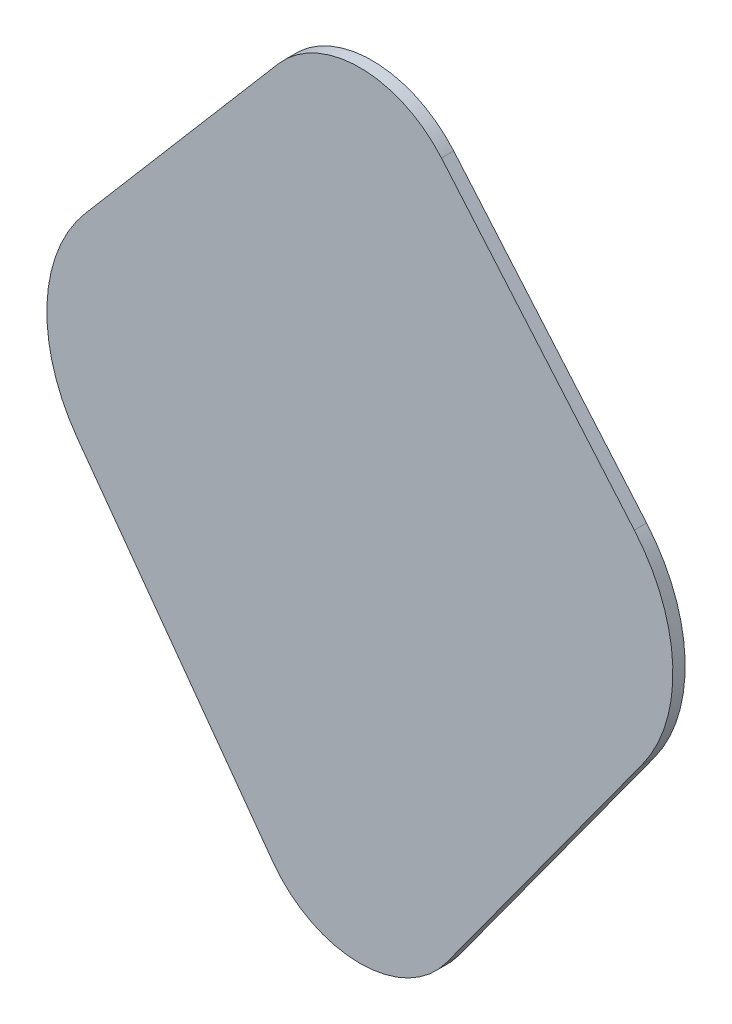
ISO-10303-21;
HEADER;
FILE_DESCRIPTION(('STEP AP214'),'2;1');
FILE_NAME('part.step','',(''),(''),'','','');
FILE_SCHEMA(('AUTOMOTIVE_DESIGN { 1 0 10303 214 1 1 1 1 }'));
ENDSEC;
DATA;
#1=APPLICATION_CONTEXT('core data for automotive mechanical design processes');
#2=APPLICATION_PROTOCOL_DEFINITION('international standard','automotive_design',2000,#1);
#3=PRODUCT_CONTEXT('',#1,'mechanical');
#4=PRODUCT('Part','Part','',(#3));
#5=PRODUCT_RELATED_PRODUCT_CATEGORY('part','',(#4));
#6=PRODUCT_DEFINITION_FORMATION('','',#4);
#7=PRODUCT_DEFINITION_CONTEXT('part definition',#1,'design');
#8=PRODUCT_DEFINITION('design','',#6,#7);
#9=PRODUCT_DEFINITION_SHAPE('','',#8);
#10=(LENGTH_UNIT() NAMED_UNIT(*) SI_UNIT(.MILLI.,.METRE.));
#11=(NAMED_UNIT(*) PLANE_ANGLE_UNIT() SI_UNIT($,.RADIAN.));
#12=(NAMED_UNIT(*) SI_UNIT($,.STERADIAN.) SOLID_ANGLE_UNIT());
#13=UNCERTAINTY_MEASURE_WITH_UNIT(LENGTH_MEASURE(1.E-05),#10,'distance_accuracy_value','');
#14=(GEOMETRIC_REPRESENTATION_CONTEXT(3) GLOBAL_UNCERTAINTY_ASSIGNED_CONTEXT((#13)) GLOBAL_UNIT_ASSIGNED_CONTEXT((#10,
#11,#12)) REPRESENTATION_CONTEXT('',''));
#15=CARTESIAN_POINT('',(0.,0.,0.));
#16=DIRECTION('',(0.,0.,1.));
#17=DIRECTION('',(1.,0.,0.));
#18=AXIS2_PLACEMENT_3D('',#15,#16,#17);
#19=CARTESIAN_POINT('',(0.,0.,0.));
#20=DIRECTION('',(0.,0.,1.));
#21=DIRECTION('',(1.,0.,0.));
#22=AXIS2_PLACEMENT_3D('',#19,#20,#21);
#23=PLANE('',#22);
#24=CARTESIAN_POINT('',(0.,54.1403788548097,0.));
#25=DIRECTION('',(0.,0.,1.));
#26=DIRECTION('',(1.,0.,0.));
#27=AXIS2_PLACEMENT_3D('',#24,#25,#26);
#28=CIRCLE('',#27,7.);
#29=CARTESIAN_POINT('',(-5.3228417592002,58.686515193121,0.));
#30=VERTEX_POINT('',#29);
#31=CARTESIAN_POINT('',(5.32284175920021,58.686515193121,0.));
#32=VERTEX_POINT('',#31);
#33=EDGE_CURVE('E148',#30,#32,#28,.F.);
#34=ORIENTED_EDGE('',*,*,#33,.T.);
#35=DIRECTION('',(-0.649448048330185,0.76040596560003,0.));
#36=VECTOR('',#35,1.);
#37=CARTESIAN_POINT('',(32.0597522343498,27.3816151641025,0.));
#38=LINE('',#37,#36);
#39=CARTESIAN_POINT('',(17.9061032827031,43.9534088980471,0.));
#40=VERTEX_POINT('',#39);
#41=EDGE_CURVE('E178',#40,#32,#38,.T.);
#42=ORIENTED_EDGE('',*,*,#41,.F.);
#43=CARTESIAN_POINT('',(9.9218406439028,37.1342043905801,0.));
#44=DIRECTION('',(0.,0.,1.));
#45=DIRECTION('',(1.,0.,0.));
#46=AXIS2_PLACEMENT_3D('',#43,#44,#45);
#47=CIRCLE('',#46,10.5);
#48=CARTESIAN_POINT('',(18.4165190848397,30.9624592415091,0.));
#49=VERTEX_POINT('',#48);
#50=EDGE_CURVE('E189',#40,#49,#47,.F.);
#51=ORIENTED_EDGE('',*,*,#50,.T.);
#52=DIRECTION('',(0.587785252292474,0.809016994374947,0.));
#53=VECTOR('',#52,1.);
#54=CARTESIAN_POINT('',(-2.66975608143732,1.93969133256516,0.));
#55=LINE('',#54,#53);
#56=CARTESIAN_POINT('',(5.66311896062463,13.4089098860047,0.));
#57=VERTEX_POINT('',#56);
#58=EDGE_CURVE('E202',#57,#49,#55,.T.);
#59=ORIENTED_EDGE('',*,*,#58,.F.);
#60=CARTESIAN_POINT('',(0.,17.523406652052,0.));
#61=DIRECTION('',(0.,0.,1.));
#62=DIRECTION('',(1.,0.,0.));
#63=AXIS2_PLACEMENT_3D('',#60,#61,#62);
#64=CIRCLE('',#63,7.);
#65=CARTESIAN_POINT('',(-5.66311896062463,13.4089098860047,0.));
#66=VERTEX_POINT('',#65);
#67=EDGE_CURVE('E143',#57,#66,#64,.F.);
#68=ORIENTED_EDGE('',*,*,#67,.T.);
#69=DIRECTION('',(0.587785252292474,-0.809016994374947,0.));
#70=VECTOR('',#69,1.);
#71=CARTESIAN_POINT('',(2.66975608143733,1.93969133256517,0.));
#72=LINE('',#71,#70);
#73=CARTESIAN_POINT('',(-18.4165190848397,30.9624592415091,0.));
#74=VERTEX_POINT('',#73);
#75=EDGE_CURVE('E135',#74,#66,#72,.T.);
#76=ORIENTED_EDGE('',*,*,#75,.F.);
#77=CARTESIAN_POINT('',(-9.92184064390279,37.1342043905801,0.));
#78=DIRECTION('',(0.,0.,1.));
#79=DIRECTION('',(1.,0.,0.));
#80=AXIS2_PLACEMENT_3D('',#77,#78,#79);
#81=CIRCLE('',#80,10.5);
#82=CARTESIAN_POINT('',(-17.9061032827031,43.9534088980471,0.));
#83=VERTEX_POINT('',#82);
#84=EDGE_CURVE('E141',#74,#83,#81,.F.);
#85=ORIENTED_EDGE('',*,*,#84,.T.);
#86=DIRECTION('',(-0.649448048330185,-0.76040596560003,0.));
#87=VECTOR('',#86,1.);
#88=CARTESIAN_POINT('',(-32.0597522343498,27.3816151641024,0.));
#89=LINE('',#88,#87);
#90=EDGE_CURVE('E146',#30,#83,#89,.T.);
#91=ORIENTED_EDGE('',*,*,#90,.F.);
#92=EDGE_LOOP('',(#34,#42,#51,#59,#68,#76,#85,#91));
#93=FACE_BOUND('',#92,.T.);
#94=ADVANCED_FACE('F59',(#93),#23,.F.);
#95=CARTESIAN_POINT('',(0.,17.523406652052,0.));
#96=DIRECTION('',(0.,0.,1.));
#97=DIRECTION('',(1.,0.,0.));
#98=AXIS2_PLACEMENT_3D('',#95,#96,#97);
#99=CYLINDRICAL_SURFACE('',#98,7.);
#100=ORIENTED_EDGE('',*,*,#67,.F.);
#101=DIRECTION('',(0.,0.,-1.));
#102=VECTOR('',#101,1.);
#103=CARTESIAN_POINT('',(5.66311896062463,13.4089098860047,0.));
#104=LINE('',#103,#102);
#105=CARTESIAN_POINT('',(5.66311896062463,13.4089098860047,0.8));
#106=VERTEX_POINT('',#105);
#107=EDGE_CURVE('E204',#106,#57,#104,.T.);
#108=ORIENTED_EDGE('',*,*,#107,.F.);
#109=CARTESIAN_POINT('',(0.,17.523406652052,0.8));
#110=DIRECTION('',(0.,0.,1.));
#111=DIRECTION('',(1.,0.,0.));
#112=AXIS2_PLACEMENT_3D('',#109,#110,#111);
#113=CIRCLE('',#112,7.);
#114=CARTESIAN_POINT('',(-5.66311896062463,13.4089098860047,0.8));
#115=VERTEX_POINT('',#114);
#116=EDGE_CURVE('E101',#106,#115,#113,.F.);
#117=ORIENTED_EDGE('',*,*,#116,.T.);
#118=DIRECTION('',(0.,0.,-1.));
#119=VECTOR('',#118,1.);
#120=CARTESIAN_POINT('',(-5.66311896062463,13.4089098860047,0.));
#121=LINE('',#120,#119);
#122=EDGE_CURVE('E12',#115,#66,#121,.T.);
#123=ORIENTED_EDGE('',*,*,#122,.T.);
#124=EDGE_LOOP('',(#100,#108,#117,#123));
#125=FACE_BOUND('',#124,.T.);
#126=ADVANCED_FACE('F226',(#125),#99,.T.);
#127=CARTESIAN_POINT('',(2.66975608143733,1.93969133256517,0.));
#128=DIRECTION('',(-0.809016994374947,-0.587785252292474,0.));
#129=DIRECTION('',(0.587785252292474,-0.809016994374947,0.));
#130=AXIS2_PLACEMENT_3D('',#127,#128,#129);
#131=PLANE('',#130);
#132=ORIENTED_EDGE('',*,*,#122,.F.);
#133=DIRECTION('',(0.587785252292474,-0.809016994374947,0.));
#134=VECTOR('',#133,1.);
#135=CARTESIAN_POINT('',(2.66975608143733,1.93969133256517,0.8));
#136=LINE('',#135,#134);
#137=CARTESIAN_POINT('',(-18.4165190848397,30.9624592415091,0.8));
#138=VERTEX_POINT('',#137);
#139=EDGE_CURVE('E136',#138,#115,#136,.T.);
#140=ORIENTED_EDGE('',*,*,#139,.F.);
#141=DIRECTION('',(0.,0.,-1.));
#142=VECTOR('',#141,1.);
#143=CARTESIAN_POINT('',(-18.4165190848397,30.9624592415091,0.));
#144=LINE('',#143,#142);
#145=EDGE_CURVE('E68',#138,#74,#144,.T.);
#146=ORIENTED_EDGE('',*,*,#145,.T.);
#147=ORIENTED_EDGE('',*,*,#75,.T.);
#148=EDGE_LOOP('',(#132,#140,#146,#147));
#149=FACE_BOUND('',#148,.T.);
#150=ADVANCED_FACE('F134',(#149),#131,.T.);
#151=CARTESIAN_POINT('',(-9.92184064390279,37.1342043905801,0.));
#152=DIRECTION('',(0.,0.,1.));
#153=DIRECTION('',(1.,0.,0.));
#154=AXIS2_PLACEMENT_3D('',#151,#152,#153);
#155=CYLINDRICAL_SURFACE('',#154,10.5);
#156=ORIENTED_EDGE('',*,*,#145,.F.);
#157=CARTESIAN_POINT('',(-9.92184064390279,37.1342043905801,0.800000000000001));
#158=DIRECTION('',(0.,0.,1.));
#159=DIRECTION('',(1.,0.,0.));
#160=AXIS2_PLACEMENT_3D('',#157,#158,#159);
#161=CIRCLE('',#160,10.5);
#162=CARTESIAN_POINT('',(-17.9061032827031,43.9534088980471,0.8));
#163=VERTEX_POINT('',#162);
#164=EDGE_CURVE('E156',#138,#163,#161,.F.);
#165=ORIENTED_EDGE('',*,*,#164,.T.);
#166=DIRECTION('',(0.,0.,-1.));
#167=VECTOR('',#166,1.);
#168=CARTESIAN_POINT('',(-17.9061032827031,43.9534088980471,0.));
#169=LINE('',#168,#167);
#170=EDGE_CURVE('E137',#163,#83,#169,.T.);
#171=ORIENTED_EDGE('',*,*,#170,.T.);
#172=ORIENTED_EDGE('',*,*,#84,.F.);
#173=EDGE_LOOP('',(#156,#165,#171,#172));
#174=FACE_BOUND('',#173,.T.);
#175=ADVANCED_FACE('F145',(#174),#155,.T.);
#176=CARTESIAN_POINT('',(-32.0597522343498,27.3816151641024,0.));
#177=DIRECTION('',(-0.76040596560003,0.649448048330185,0.));
#178=DIRECTION('',(-0.649448048330185,-0.76040596560003,0.));
#179=AXIS2_PLACEMENT_3D('',#176,#177,#178);
#180=PLANE('',#179);
#181=ORIENTED_EDGE('',*,*,#170,.F.);
#182=DIRECTION('',(-0.649448048330185,-0.76040596560003,0.));
#183=VECTOR('',#182,1.);
#184=CARTESIAN_POINT('',(-32.0597522343498,27.3816151641024,0.8));
#185=LINE('',#184,#183);
#186=CARTESIAN_POINT('',(-5.3228417592002,58.686515193121,0.8));
#187=VERTEX_POINT('',#186);
#188=EDGE_CURVE('E152',#187,#163,#185,.T.);
#189=ORIENTED_EDGE('',*,*,#188,.F.);
#190=DIRECTION('',(0.,0.,-1.));
#191=VECTOR('',#190,1.);
#192=CARTESIAN_POINT('',(-5.3228417592002,58.686515193121,0.));
#193=LINE('',#192,#191);
#194=EDGE_CURVE('E77',#187,#30,#193,.T.);
#195=ORIENTED_EDGE('',*,*,#194,.T.);
#196=ORIENTED_EDGE('',*,*,#90,.T.);
#197=EDGE_LOOP('',(#181,#189,#195,#196));
#198=FACE_BOUND('',#197,.T.);
#199=ADVANCED_FACE('F215',(#198),#180,.T.);
#200=CARTESIAN_POINT('',(0.,54.1403788548097,0.));
#201=DIRECTION('',(0.,0.,1.));
#202=DIRECTION('',(1.,0.,0.));
#203=AXIS2_PLACEMENT_3D('',#200,#201,#202);
#204=CYLINDRICAL_SURFACE('',#203,7.);
#205=CARTESIAN_POINT('',(0.,54.1403788548097,0.8));
#206=DIRECTION('',(0.,0.,1.));
#207=DIRECTION('',(1.,0.,0.));
#208=AXIS2_PLACEMENT_3D('',#205,#206,#207);
#209=CIRCLE('',#208,7.);
#210=CARTESIAN_POINT('',(5.32284175920021,58.686515193121,0.8));
#211=VERTEX_POINT('',#210);
#212=EDGE_CURVE('E155',#187,#211,#209,.F.);
#213=ORIENTED_EDGE('',*,*,#212,.T.);
#214=DIRECTION('',(0.,0.,-1.));
#215=VECTOR('',#214,1.);
#216=CARTESIAN_POINT('',(5.32284175920021,58.686515193121,0.));
#217=LINE('',#216,#215);
#218=EDGE_CURVE('E182',#211,#32,#217,.T.);
#219=ORIENTED_EDGE('',*,*,#218,.T.);
#220=ORIENTED_EDGE('',*,*,#33,.F.);
#221=ORIENTED_EDGE('',*,*,#194,.F.);
#222=EDGE_LOOP('',(#213,#219,#220,#221));
#223=FACE_BOUND('',#222,.T.);
#224=ADVANCED_FACE('F183',(#223),#204,.T.);
#225=CARTESIAN_POINT('',(0.,0.,0.8));
#226=DIRECTION('',(0.,0.,1.));
#227=DIRECTION('',(1.,0.,0.));
#228=AXIS2_PLACEMENT_3D('',#225,#226,#227);
#229=PLANE('',#228);
#230=ORIENTED_EDGE('',*,*,#116,.F.);
#231=DIRECTION('',(0.587785252292474,0.809016994374947,0.));
#232=VECTOR('',#231,1.);
#233=CARTESIAN_POINT('',(-2.66975608143732,1.93969133256516,0.8));
#234=LINE('',#233,#232);
#235=CARTESIAN_POINT('',(18.4165190848397,30.9624592415091,0.8));
#236=VERTEX_POINT('',#235);
#237=EDGE_CURVE('E188',#106,#236,#234,.T.);
#238=ORIENTED_EDGE('',*,*,#237,.T.);
#239=CARTESIAN_POINT('',(9.9218406439028,37.1342043905801,0.8));
#240=DIRECTION('',(0.,0.,1.));
#241=DIRECTION('',(1.,0.,0.));
#242=AXIS2_PLACEMENT_3D('',#239,#240,#241);
#243=CIRCLE('',#242,10.5);
#244=CARTESIAN_POINT('',(17.9061032827031,43.9534088980471,0.8));
#245=VERTEX_POINT('',#244);
#246=EDGE_CURVE('E199',#245,#236,#243,.F.);
#247=ORIENTED_EDGE('',*,*,#246,.F.);
#248=DIRECTION('',(-0.649448048330185,0.76040596560003,0.));
#249=VECTOR('',#248,1.);
#250=CARTESIAN_POINT('',(32.0597522343498,27.3816151641025,0.8));
#251=LINE('',#250,#249);
#252=EDGE_CURVE('E166',#245,#211,#251,.T.);
#253=ORIENTED_EDGE('',*,*,#252,.T.);
#254=ORIENTED_EDGE('',*,*,#212,.F.);
#255=ORIENTED_EDGE('',*,*,#188,.T.);
#256=ORIENTED_EDGE('',*,*,#164,.F.);
#257=ORIENTED_EDGE('',*,*,#139,.T.);
#258=EDGE_LOOP('',(#230,#238,#247,#253,#254,#255,#256,#257));
#259=FACE_BOUND('',#258,.T.);
#260=ADVANCED_FACE('F212',(#259),#229,.T.);
#261=CARTESIAN_POINT('',(-2.66975608143732,1.93969133256516,0.));
#262=DIRECTION('',(0.809016994374947,-0.587785252292474,0.));
#263=DIRECTION('',(0.587785252292474,0.809016994374947,0.));
#264=AXIS2_PLACEMENT_3D('',#261,#262,#263);
#265=PLANE('',#264);
#266=DIRECTION('',(0.,0.,-1.));
#267=VECTOR('',#266,1.);
#268=CARTESIAN_POINT('',(18.4165190848397,30.9624592415091,0.));
#269=LINE('',#268,#267);
#270=EDGE_CURVE('E195',#236,#49,#269,.T.);
#271=ORIENTED_EDGE('',*,*,#270,.F.);
#272=ORIENTED_EDGE('',*,*,#237,.F.);
#273=ORIENTED_EDGE('',*,*,#107,.T.);
#274=ORIENTED_EDGE('',*,*,#58,.T.);
#275=EDGE_LOOP('',(#271,#272,#273,#274));
#276=FACE_BOUND('',#275,.T.);
#277=ADVANCED_FACE('F208',(#276),#265,.T.);
#278=CARTESIAN_POINT('',(9.9218406439028,37.1342043905801,0.));
#279=DIRECTION('',(0.,0.,1.));
#280=DIRECTION('',(1.,0.,0.));
#281=AXIS2_PLACEMENT_3D('',#278,#279,#280);
#282=CYLINDRICAL_SURFACE('',#281,10.5);
#283=ORIENTED_EDGE('',*,*,#246,.T.);
#284=ORIENTED_EDGE('',*,*,#270,.T.);
#285=ORIENTED_EDGE('',*,*,#50,.F.);
#286=DIRECTION('',(0.,0.,-1.));
#287=VECTOR('',#286,1.);
#288=CARTESIAN_POINT('',(17.9061032827031,43.9534088980471,0.));
#289=LINE('',#288,#287);
#290=EDGE_CURVE('E192',#245,#40,#289,.T.);
#291=ORIENTED_EDGE('',*,*,#290,.F.);
#292=EDGE_LOOP('',(#283,#284,#285,#291));
#293=FACE_BOUND('',#292,.T.);
#294=ADVANCED_FACE('F210',(#293),#282,.T.);
#295=CARTESIAN_POINT('',(32.0597522343498,27.3816151641025,0.));
#296=DIRECTION('',(0.760405965600029,0.649448048330185,0.));
#297=DIRECTION('',(-0.649448048330185,0.76040596560003,0.));
#298=AXIS2_PLACEMENT_3D('',#295,#296,#297);
#299=PLANE('',#298);
#300=ORIENTED_EDGE('',*,*,#218,.F.);
#301=ORIENTED_EDGE('',*,*,#252,.F.);
#302=ORIENTED_EDGE('',*,*,#290,.T.);
#303=ORIENTED_EDGE('',*,*,#41,.T.);
#304=EDGE_LOOP('',(#300,#301,#302,#303));
#305=FACE_BOUND('',#304,.T.);
#306=ADVANCED_FACE('F191',(#305),#299,.T.);
#307=CLOSED_SHELL('',(#94,#126,#150,#175,#199,#224,#260,#277,#294,#306));
#308=MANIFOLD_SOLID_BREP('B2',#307);
#309=ADVANCED_BREP_SHAPE_REPRESENTATION('',(#18,#308),#14);
#310=SHAPE_DEFINITION_REPRESENTATION(#9,#309);
ENDSEC;
END-ISO-10303-21;
